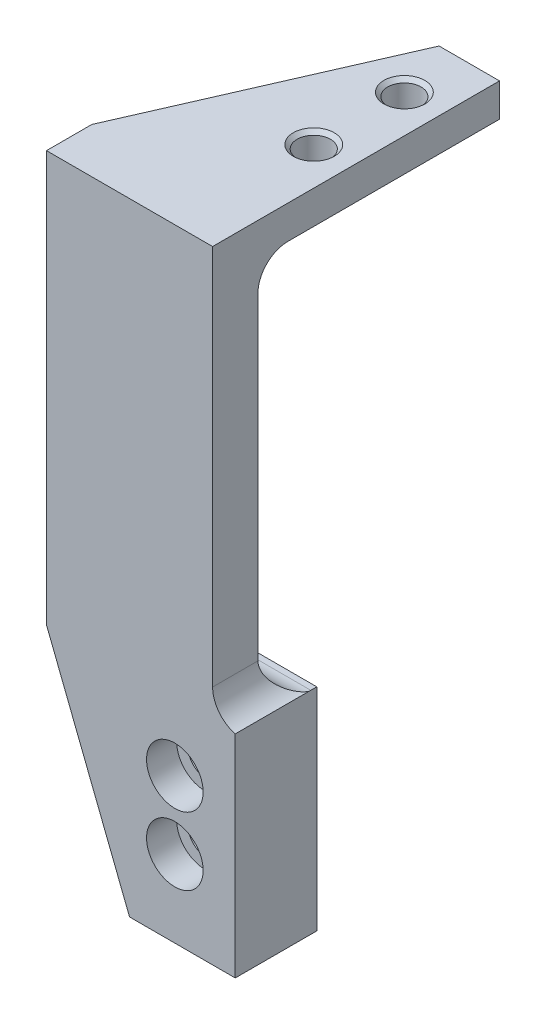
ISO-10303-21;
HEADER;
FILE_DESCRIPTION(('STEP AP214'),'2;1');
FILE_NAME('part.step','',(''),(''),'','','');
FILE_SCHEMA(('AUTOMOTIVE_DESIGN { 1 0 10303 214 1 1 1 1 }'));
ENDSEC;
DATA;
#1=APPLICATION_CONTEXT('core data for automotive mechanical design processes');
#2=APPLICATION_PROTOCOL_DEFINITION('international standard','automotive_design',2000,#1);
#3=PRODUCT_CONTEXT('',#1,'mechanical');
#4=PRODUCT('Part','Part','',(#3));
#5=PRODUCT_RELATED_PRODUCT_CATEGORY('part','',(#4));
#6=PRODUCT_DEFINITION_FORMATION('','',#4);
#7=PRODUCT_DEFINITION_CONTEXT('part definition',#1,'design');
#8=PRODUCT_DEFINITION('design','',#6,#7);
#9=PRODUCT_DEFINITION_SHAPE('','',#8);
#10=(LENGTH_UNIT() NAMED_UNIT(*) SI_UNIT(.MILLI.,.METRE.));
#11=(NAMED_UNIT(*) PLANE_ANGLE_UNIT() SI_UNIT($,.RADIAN.));
#12=(NAMED_UNIT(*) SI_UNIT($,.STERADIAN.) SOLID_ANGLE_UNIT());
#13=UNCERTAINTY_MEASURE_WITH_UNIT(LENGTH_MEASURE(1.E-05),#10,'distance_accuracy_value','');
#14=(GEOMETRIC_REPRESENTATION_CONTEXT(3) GLOBAL_UNCERTAINTY_ASSIGNED_CONTEXT((#13)) GLOBAL_UNIT_ASSIGNED_CONTEXT((#10,
#11,#12)) REPRESENTATION_CONTEXT('',''));
#15=CARTESIAN_POINT('',(0.,0.,0.));
#16=DIRECTION('',(0.,0.,1.));
#17=DIRECTION('',(1.,0.,0.));
#18=AXIS2_PLACEMENT_3D('',#15,#16,#17);
#19=CARTESIAN_POINT('',(-49.6524096385542,36.7948072289157,7.62));
#20=DIRECTION('',(-1.,0.,0.));
#21=DIRECTION('',(0.,-1.,0.));
#22=AXIS2_PLACEMENT_3D('',#19,#20,#21);
#23=PLANE('',#22);
#24=DIRECTION('',(0.,1.,0.));
#25=VECTOR('',#24,1.);
#26=CARTESIAN_POINT('',(-49.6524096385542,36.7948072289157,7.62));
#27=LINE('',#26,#25);
#28=CARTESIAN_POINT('',(-49.6524096385542,-27.3745039214009,7.62));
#29=VERTEX_POINT('',#28);
#30=CARTESIAN_POINT('',(-49.6524096385542,36.7948072289157,7.62));
#31=VERTEX_POINT('',#30);
#32=EDGE_CURVE('E216',#29,#31,#27,.T.);
#33=ORIENTED_EDGE('',*,*,#32,.F.);
#34=DIRECTION('',(0.,0.,1.));
#35=VECTOR('',#34,1.);
#36=CARTESIAN_POINT('',(-49.6524096385542,-27.3745039214009,7.62));
#37=LINE('',#36,#35);
#38=CARTESIAN_POINT('',(-49.6524096385542,-27.3745039214009,-0.0025617962614707));
#39=VERTEX_POINT('',#38);
#40=EDGE_CURVE('E61',#29,#39,#37,.F.);
#41=ORIENTED_EDGE('',*,*,#40,.T.);
#42=CARTESIAN_POINT('',(-49.6524096385542,-27.2131927710843,-5.08));
#43=DIRECTION('',(-1.,0.,0.));
#44=DIRECTION('',(0.,-1.,0.));
#45=AXIS2_PLACEMENT_3D('',#42,#43,#44);
#46=CIRCLE('',#45,5.08);
#47=CARTESIAN_POINT('',(-49.6524096385542,-27.2131927710843,0.));
#48=VERTEX_POINT('',#47);
#49=EDGE_CURVE('E239',#39,#48,#46,.T.);
#50=ORIENTED_EDGE('',*,*,#49,.T.);
#51=DIRECTION('',(0.,1.,0.));
#52=VECTOR('',#51,1.);
#53=CARTESIAN_POINT('',(-49.6524096385542,36.7948072289157,0.));
#54=LINE('',#53,#52);
#55=CARTESIAN_POINT('',(-49.6524096385542,26.1268072289157,0.));
#56=VERTEX_POINT('',#55);
#57=EDGE_CURVE('E217',#48,#56,#54,.T.);
#58=ORIENTED_EDGE('',*,*,#57,.T.);
#59=CARTESIAN_POINT('',(-49.6524096385542,26.1268072289157,-5.08));
#60=DIRECTION('',(-1.,0.,0.));
#61=DIRECTION('',(0.,-1.,0.));
#62=AXIS2_PLACEMENT_3D('',#59,#60,#61);
#63=CIRCLE('',#62,5.08);
#64=CARTESIAN_POINT('',(-49.6524096385542,31.2068072289157,-5.08));
#65=VERTEX_POINT('',#64);
#66=EDGE_CURVE('E228',#56,#65,#63,.T.);
#67=ORIENTED_EDGE('',*,*,#66,.T.);
#68=DIRECTION('',(0.,0.,-1.));
#69=VECTOR('',#68,1.);
#70=CARTESIAN_POINT('',(-49.6524096385542,31.2068072289157,0.));
#71=LINE('',#70,#69);
#72=CARTESIAN_POINT('',(-49.6524096385542,31.2068072289157,-40.64));
#73=VERTEX_POINT('',#72);
#74=EDGE_CURVE('E201',#65,#73,#71,.T.);
#75=ORIENTED_EDGE('',*,*,#74,.T.);
#76=DIRECTION('',(0.,1.,0.));
#77=VECTOR('',#76,1.);
#78=CARTESIAN_POINT('',(-49.6524096385542,31.2068072289157,-40.64));
#79=LINE('',#78,#77);
#80=CARTESIAN_POINT('',(-49.6524096385542,36.7948072289157,-40.64));
#81=VERTEX_POINT('',#80);
#82=EDGE_CURVE('E211',#73,#81,#79,.T.);
#83=ORIENTED_EDGE('',*,*,#82,.T.);
#84=DIRECTION('',(0.,0.,-1.));
#85=VECTOR('',#84,1.);
#86=CARTESIAN_POINT('',(-49.6524096385542,36.7948072289157,7.62));
#87=LINE('',#86,#85);
#88=EDGE_CURVE('E261',#31,#81,#87,.T.);
#89=ORIENTED_EDGE('',*,*,#88,.F.);
#90=EDGE_LOOP('',(#33,#41,#50,#58,#67,#75,#83,#89));
#91=FACE_BOUND('',#90,.T.);
#92=ADVANCED_FACE('F35',(#91),#23,.F.);
#93=CARTESIAN_POINT('',(-77.5924096385542,36.7948072289157,7.62));
#94=DIRECTION('',(1.,0.,0.));
#95=DIRECTION('',(0.,1.,0.));
#96=AXIS2_PLACEMENT_3D('',#93,#94,#95);
#97=PLANE('',#96);
#98=DIRECTION('',(0.,-1.,0.));
#99=VECTOR('',#98,1.);
#100=CARTESIAN_POINT('',(-77.5924096385542,36.7948072289157,0.));
#101=LINE('',#100,#99);
#102=CARTESIAN_POINT('',(-77.5924096385542,36.7948072289157,0.));
#103=VERTEX_POINT('',#102);
#104=CARTESIAN_POINT('',(-77.5924096385542,26.1268072289157,0.));
#105=VERTEX_POINT('',#104);
#106=EDGE_CURVE('E250',#103,#105,#101,.T.);
#107=ORIENTED_EDGE('',*,*,#106,.T.);
#108=CARTESIAN_POINT('',(-77.5924096385542,-27.2131927710843,0.));
#109=VERTEX_POINT('',#108);
#110=EDGE_CURVE('E210',#105,#109,#101,.T.);
#111=ORIENTED_EDGE('',*,*,#110,.T.);
#112=CARTESIAN_POINT('',(-77.5924096385542,-27.2131927710843,-5.08));
#113=DIRECTION('',(1.,0.,0.));
#114=DIRECTION('',(0.,1.,0.));
#115=AXIS2_PLACEMENT_3D('',#112,#113,#114);
#116=CIRCLE('',#115,5.08);
#117=CARTESIAN_POINT('',(-77.5924096385542,-32.2931927710843,-5.08));
#118=VERTEX_POINT('',#117);
#119=EDGE_CURVE('E234',#109,#118,#116,.T.);
#120=ORIENTED_EDGE('',*,*,#119,.T.);
#121=DIRECTION('',(0.,0.,-1.));
#122=VECTOR('',#121,1.);
#123=CARTESIAN_POINT('',(-77.5924096385542,-32.2931927710843,7.62));
#124=LINE('',#123,#122);
#125=CARTESIAN_POINT('',(-77.5924096385542,-32.2931927710843,7.62));
#126=VERTEX_POINT('',#125);
#127=EDGE_CURVE('E259',#126,#118,#124,.T.);
#128=ORIENTED_EDGE('',*,*,#127,.F.);
#129=DIRECTION('',(0.,-1.,0.));
#130=VECTOR('',#129,1.);
#131=CARTESIAN_POINT('',(-77.5924096385542,36.7948072289157,7.62));
#132=LINE('',#131,#130);
#133=CARTESIAN_POINT('',(-77.5924096385542,36.7948072289157,7.62));
#134=VERTEX_POINT('',#133);
#135=EDGE_CURVE('E214',#134,#126,#132,.T.);
#136=ORIENTED_EDGE('',*,*,#135,.F.);
#137=DIRECTION('',(0.,0.,-1.));
#138=VECTOR('',#137,1.);
#139=CARTESIAN_POINT('',(-77.5924096385542,36.7948072289157,7.62));
#140=LINE('',#139,#138);
#141=EDGE_CURVE('E273',#134,#103,#140,.T.);
#142=ORIENTED_EDGE('',*,*,#141,.T.);
#143=EDGE_LOOP('',(#107,#111,#120,#128,#136,#142));
#144=FACE_BOUND('',#143,.T.);
#145=ADVANCED_FACE('F291',(#144),#97,.F.);
#146=CARTESIAN_POINT('',(-77.5924096385542,36.7948072289157,7.62));
#147=DIRECTION('',(0.,-1.,0.));
#148=DIRECTION('',(0.,0.,-1.));
#149=AXIS2_PLACEMENT_3D('',#146,#147,#148);
#150=PLANE('',#149);
#151=CARTESIAN_POINT('',(-56.0024096385542,36.7948072289157,-30.988));
#152=DIRECTION('',(0.,1.,0.));
#153=DIRECTION('',(0.,0.,1.));
#154=AXIS2_PLACEMENT_3D('',#151,#152,#153);
#155=CIRCLE('',#154,3.4417);
#156=CARTESIAN_POINT('',(-56.0024096385542,36.7948072289157,-27.5463));
#157=VERTEX_POINT('',#156);
#158=EDGE_CURVE('E186',#157,#157,#155,.T.);
#159=ORIENTED_EDGE('',*,*,#158,.F.);
#160=EDGE_LOOP('',(#159));
#161=FACE_BOUND('',#160,.T.);
#162=CARTESIAN_POINT('',(-56.0024096385542,36.7948072289157,-15.748));
#163=DIRECTION('',(0.,1.,0.));
#164=DIRECTION('',(0.,0.,1.));
#165=AXIS2_PLACEMENT_3D('',#162,#163,#164);
#166=CIRCLE('',#165,3.4417);
#167=CARTESIAN_POINT('',(-56.0024096385542,36.7948072289157,-12.3063));
#168=VERTEX_POINT('',#167);
#169=EDGE_CURVE('E193',#168,#168,#166,.T.);
#170=ORIENTED_EDGE('',*,*,#169,.F.);
#171=EDGE_LOOP('',(#170));
#172=FACE_BOUND('',#171,.T.);
#173=ORIENTED_EDGE('',*,*,#88,.T.);
#174=DIRECTION('',(-1.,0.,0.));
#175=VECTOR('',#174,1.);
#176=CARTESIAN_POINT('',(-49.6524096385542,36.7948072289157,-40.64));
#177=LINE('',#176,#175);
#178=CARTESIAN_POINT('',(-59.8124096385542,36.7948072289157,-40.64));
#179=VERTEX_POINT('',#178);
#180=EDGE_CURVE('E202',#81,#179,#177,.T.);
#181=ORIENTED_EDGE('',*,*,#180,.T.);
#182=DIRECTION('',(-0.400818834019708,0.,0.916157334902189));
#183=VECTOR('',#182,1.);
#184=CARTESIAN_POINT('',(-59.8124096385542,36.7948072289157,-40.64));
#185=LINE('',#184,#183);
#186=EDGE_CURVE('E205',#179,#103,#185,.T.);
#187=ORIENTED_EDGE('',*,*,#186,.T.);
#188=ORIENTED_EDGE('',*,*,#141,.F.);
#189=DIRECTION('',(-1.,0.,0.));
#190=VECTOR('',#189,1.);
#191=CARTESIAN_POINT('',(-77.5924096385542,36.7948072289157,7.62));
#192=LINE('',#191,#190);
#193=EDGE_CURVE('E220',#31,#134,#192,.T.);
#194=ORIENTED_EDGE('',*,*,#193,.F.);
#195=EDGE_LOOP('',(#173,#181,#187,#188,#194));
#196=FACE_BOUND('',#195,.T.);
#197=ADVANCED_FACE('F278',(#161,#172,#196),#150,.F.);
#198=CARTESIAN_POINT('',(-77.5924096385542,36.7948072289157,7.62));
#199=DIRECTION('',(0.,0.,1.));
#200=DIRECTION('',(1.,0.,0.));
#201=AXIS2_PLACEMENT_3D('',#198,#199,#200);
#202=PLANE('',#201);
#203=CARTESIAN_POINT('',(-56.0024096385542,-43.4691927710843,7.62));
#204=DIRECTION('',(0.,0.,1.));
#205=DIRECTION('',(1.,0.,0.));
#206=AXIS2_PLACEMENT_3D('',#203,#204,#205);
#207=CIRCLE('',#206,4.76249999999999);
#208=CARTESIAN_POINT('',(-51.2399096385542,-43.4691927710843,7.62));
#209=VERTEX_POINT('',#208);
#210=EDGE_CURVE('E591',#209,#209,#207,.T.);
#211=ORIENTED_EDGE('',*,*,#210,.F.);
#212=EDGE_LOOP('',(#211));
#213=FACE_BOUND('',#212,.T.);
#214=CARTESIAN_POINT('',(-56.0024096385542,-54.8991927710843,7.62));
#215=DIRECTION('',(0.,0.,1.));
#216=DIRECTION('',(1.,0.,0.));
#217=AXIS2_PLACEMENT_3D('',#214,#215,#216);
#218=CIRCLE('',#217,4.76249999999999);
#219=CARTESIAN_POINT('',(-51.2399096385542,-54.8991927710843,7.62));
#220=VERTEX_POINT('',#219);
#221=EDGE_CURVE('E581',#220,#220,#218,.T.);
#222=ORIENTED_EDGE('',*,*,#221,.F.);
#223=EDGE_LOOP('',(#222));
#224=FACE_BOUND('',#223,.T.);
#225=ORIENTED_EDGE('',*,*,#135,.T.);
#226=DIRECTION('',(0.365652372422994,-0.930751493440347,0.));
#227=VECTOR('',#226,1.);
#228=CARTESIAN_POINT('',(-77.5924096385542,-32.2931927710843,7.62));
#229=LINE('',#228,#227);
#230=CARTESIAN_POINT('',(-63.6224096385542,-67.8531927710843,7.62));
#231=VERTEX_POINT('',#230);
#232=EDGE_CURVE('E169',#126,#231,#229,.T.);
#233=ORIENTED_EDGE('',*,*,#232,.T.);
#234=DIRECTION('',(1.,0.,0.));
#235=VECTOR('',#234,1.);
#236=CARTESIAN_POINT('',(-63.6224096385542,-67.8531927710843,7.62));
#237=LINE('',#236,#235);
#238=CARTESIAN_POINT('',(-45.8424096385542,-67.8531927710843,7.62));
#239=VERTEX_POINT('',#238);
#240=EDGE_CURVE('E142',#231,#239,#237,.T.);
#241=ORIENTED_EDGE('',*,*,#240,.T.);
#242=DIRECTION('',(0.,-1.,0.));
#243=VECTOR('',#242,1.);
#244=CARTESIAN_POINT('',(-45.8424096385542,-32.2931927710843,7.62));
#245=LINE('',#244,#243);
#246=CARTESIAN_POINT('',(-45.8424096385542,-32.2931927710843,7.62));
#247=VERTEX_POINT('',#246);
#248=EDGE_CURVE('E152',#247,#239,#245,.T.);
#249=ORIENTED_EDGE('',*,*,#248,.F.);
#250=CARTESIAN_POINT('',(-44.5724096385542,-27.3745039214009,7.62));
#251=DIRECTION('',(0.,0.,1.));
#252=DIRECTION('',(1.,0.,0.));
#253=AXIS2_PLACEMENT_3D('',#250,#251,#252);
#254=CIRCLE('',#253,5.08);
#255=EDGE_CURVE('E48',#247,#29,#254,.F.);
#256=ORIENTED_EDGE('',*,*,#255,.T.);
#257=ORIENTED_EDGE('',*,*,#32,.T.);
#258=ORIENTED_EDGE('',*,*,#193,.T.);
#259=EDGE_LOOP('',(#225,#233,#241,#249,#256,#257,#258));
#260=FACE_BOUND('',#259,.T.);
#261=ADVANCED_FACE('F295',(#213,#224,#260),#202,.T.);
#262=CARTESIAN_POINT('',(-77.5924096385542,36.7948072289157,0.));
#263=DIRECTION('',(0.,0.,1.));
#264=DIRECTION('',(1.,0.,0.));
#265=AXIS2_PLACEMENT_3D('',#262,#263,#264);
#266=PLANE('',#265);
#267=ORIENTED_EDGE('',*,*,#57,.F.);
#268=DIRECTION('',(1.,0.,0.));
#269=VECTOR('',#268,1.);
#270=CARTESIAN_POINT('',(-77.5924096385542,-27.2131927710843,0.));
#271=LINE('',#270,#269);
#272=EDGE_CURVE('E243',#48,#109,#271,.F.);
#273=ORIENTED_EDGE('',*,*,#272,.T.);
#274=ORIENTED_EDGE('',*,*,#110,.F.);
#275=DIRECTION('',(1.,0.,0.));
#276=VECTOR('',#275,1.);
#277=CARTESIAN_POINT('',(-49.6524096385542,26.1268072289157,0.));
#278=LINE('',#277,#276);
#279=EDGE_CURVE('E265',#105,#56,#278,.T.);
#280=ORIENTED_EDGE('',*,*,#279,.T.);
#281=EDGE_LOOP('',(#267,#273,#274,#280));
#282=FACE_BOUND('',#281,.T.);
#283=ADVANCED_FACE('F306',(#282),#266,.F.);
#284=CARTESIAN_POINT('',(-59.8124096385542,31.2068072289157,-40.64));
#285=DIRECTION('',(-0.916157334902189,0.,-0.400818834019708));
#286=DIRECTION('',(-0.400818834019708,0.,0.916157334902189));
#287=AXIS2_PLACEMENT_3D('',#284,#285,#286);
#288=PLANE('',#287);
#289=ORIENTED_EDGE('',*,*,#186,.F.);
#290=DIRECTION('',(0.,1.,0.));
#291=VECTOR('',#290,1.);
#292=CARTESIAN_POINT('',(-59.8124096385542,31.2068072289157,-40.64));
#293=LINE('',#292,#291);
#294=CARTESIAN_POINT('',(-59.8124096385542,31.2068072289157,-40.64));
#295=VERTEX_POINT('',#294);
#296=EDGE_CURVE('E208',#295,#179,#293,.T.);
#297=ORIENTED_EDGE('',*,*,#296,.F.);
#298=DIRECTION('',(-0.400818834019708,0.,0.916157334902189));
#299=VECTOR('',#298,1.);
#300=CARTESIAN_POINT('',(-59.8124096385542,31.2068072289157,-40.64));
#301=LINE('',#300,#299);
#302=CARTESIAN_POINT('',(-75.3699096385542,31.2068072289157,-5.08));
#303=VERTEX_POINT('',#302);
#304=EDGE_CURVE('E200',#295,#303,#301,.T.);
#305=ORIENTED_EDGE('',*,*,#304,.T.);
#306=CARTESIAN_POINT('',(-75.3699096385542,26.1268072289157,-5.08));
#307=DIRECTION('',(-0.916157334902189,0.,-0.400818834019708));
#308=DIRECTION('',(-0.400818834019708,0.,0.916157334902189));
#309=AXIS2_PLACEMENT_3D('',#306,#307,#308);
#310=ELLIPSE('',#309,5.54489911991192,5.08);
#311=EDGE_CURVE('E226',#303,#105,#310,.F.);
#312=ORIENTED_EDGE('',*,*,#311,.T.);
#313=ORIENTED_EDGE('',*,*,#106,.F.);
#314=EDGE_LOOP('',(#289,#297,#305,#312,#313));
#315=FACE_BOUND('',#314,.T.);
#316=ADVANCED_FACE('F288',(#315),#288,.T.);
#317=CARTESIAN_POINT('',(-49.6524096385542,31.2068072289157,-40.64));
#318=DIRECTION('',(0.,0.,-1.));
#319=DIRECTION('',(-1.,0.,0.));
#320=AXIS2_PLACEMENT_3D('',#317,#318,#319);
#321=PLANE('',#320);
#322=ORIENTED_EDGE('',*,*,#180,.F.);
#323=ORIENTED_EDGE('',*,*,#82,.F.);
#324=DIRECTION('',(-1.,0.,0.));
#325=VECTOR('',#324,1.);
#326=CARTESIAN_POINT('',(-49.6524096385542,31.2068072289157,-40.64));
#327=LINE('',#326,#325);
#328=EDGE_CURVE('E197',#73,#295,#327,.T.);
#329=ORIENTED_EDGE('',*,*,#328,.T.);
#330=ORIENTED_EDGE('',*,*,#296,.T.);
#331=EDGE_LOOP('',(#322,#323,#329,#330));
#332=FACE_BOUND('',#331,.T.);
#333=ADVANCED_FACE('F286',(#332),#321,.T.);
#334=CARTESIAN_POINT('',(-49.6524096385542,31.2068072289157,0.));
#335=DIRECTION('',(0.,1.,0.));
#336=DIRECTION('',(0.,0.,1.));
#337=AXIS2_PLACEMENT_3D('',#334,#335,#336);
#338=PLANE('',#337);
#339=CARTESIAN_POINT('',(-56.0024096385542,31.2068072289157,-30.988));
#340=DIRECTION('',(0.,1.,0.));
#341=DIRECTION('',(0.,0.,1.));
#342=AXIS2_PLACEMENT_3D('',#339,#340,#341);
#343=CIRCLE('',#342,2.80669999999999);
#344=CARTESIAN_POINT('',(-56.0024096385542,31.2068072289157,-28.1813));
#345=VERTEX_POINT('',#344);
#346=EDGE_CURVE('E189',#345,#345,#343,.T.);
#347=ORIENTED_EDGE('',*,*,#346,.T.);
#348=EDGE_LOOP('',(#347));
#349=FACE_BOUND('',#348,.T.);
#350=CARTESIAN_POINT('',(-56.0024096385542,31.2068072289157,-15.748));
#351=DIRECTION('',(0.,1.,0.));
#352=DIRECTION('',(0.,0.,1.));
#353=AXIS2_PLACEMENT_3D('',#350,#351,#352);
#354=CIRCLE('',#353,2.80669999999999);
#355=CARTESIAN_POINT('',(-56.0024096385542,31.2068072289157,-12.9413));
#356=VERTEX_POINT('',#355);
#357=EDGE_CURVE('E196',#356,#356,#354,.T.);
#358=ORIENTED_EDGE('',*,*,#357,.T.);
#359=EDGE_LOOP('',(#358));
#360=FACE_BOUND('',#359,.T.);
#361=ORIENTED_EDGE('',*,*,#74,.F.);
#362=DIRECTION('',(1.,0.,0.));
#363=VECTOR('',#362,1.);
#364=CARTESIAN_POINT('',(-77.5924096385542,31.2068072289157,-5.08));
#365=LINE('',#364,#363);
#366=EDGE_CURVE('E241',#65,#303,#365,.F.);
#367=ORIENTED_EDGE('',*,*,#366,.T.);
#368=ORIENTED_EDGE('',*,*,#304,.F.);
#369=ORIENTED_EDGE('',*,*,#328,.F.);
#370=EDGE_LOOP('',(#361,#367,#368,#369));
#371=FACE_BOUND('',#370,.T.);
#372=ADVANCED_FACE('F311',(#349,#360,#371),#338,.F.);
#373=CARTESIAN_POINT('',(-56.0024096385542,36.7948072289157,-15.748));
#374=DIRECTION('',(0.,1.,0.));
#375=DIRECTION('',(0.,0.,1.));
#376=AXIS2_PLACEMENT_3D('',#373,#374,#375);
#377=CYLINDRICAL_SURFACE('',#376,2.80669999999999);
#378=CARTESIAN_POINT('',(-56.0024096385542,36.1598072289157,-15.748));
#379=DIRECTION('',(0.,1.,0.));
#380=DIRECTION('',(0.,0.,1.));
#381=AXIS2_PLACEMENT_3D('',#378,#379,#380);
#382=CIRCLE('',#381,2.80669999999999);
#383=CARTESIAN_POINT('',(-56.0024096385542,36.1598072289157,-12.9413));
#384=VERTEX_POINT('',#383);
#385=EDGE_CURVE('E190',#384,#384,#382,.T.);
#386=ORIENTED_EDGE('',*,*,#385,.T.);
#387=EDGE_LOOP('',(#386));
#388=FACE_BOUND('',#387,.T.);
#389=ORIENTED_EDGE('',*,*,#357,.F.);
#390=EDGE_LOOP('',(#389));
#391=FACE_BOUND('',#390,.T.);
#392=ADVANCED_FACE('F313',(#388,#391),#377,.F.);
#393=CARTESIAN_POINT('',(-56.0024096385542,36.7948072289157,-15.748));
#394=DIRECTION('',(0.,1.,0.));
#395=DIRECTION('',(0.,0.,1.));
#396=AXIS2_PLACEMENT_3D('',#393,#394,#395);
#397=CONICAL_SURFACE('',#396,3.4417,0.785398163397448);
#398=ORIENTED_EDGE('',*,*,#385,.F.);
#399=EDGE_LOOP('',(#398));
#400=FACE_BOUND('',#399,.T.);
#401=ORIENTED_EDGE('',*,*,#169,.T.);
#402=EDGE_LOOP('',(#401));
#403=FACE_BOUND('',#402,.T.);
#404=ADVANCED_FACE('F320',(#400,#403),#397,.F.);
#405=CARTESIAN_POINT('',(-56.0024096385542,36.7948072289157,-30.988));
#406=DIRECTION('',(0.,1.,0.));
#407=DIRECTION('',(0.,0.,1.));
#408=AXIS2_PLACEMENT_3D('',#405,#406,#407);
#409=CYLINDRICAL_SURFACE('',#408,2.80669999999999);
#410=CARTESIAN_POINT('',(-56.0024096385542,36.1598072289157,-30.988));
#411=DIRECTION('',(0.,1.,0.));
#412=DIRECTION('',(0.,0.,1.));
#413=AXIS2_PLACEMENT_3D('',#410,#411,#412);
#414=CIRCLE('',#413,2.80669999999999);
#415=CARTESIAN_POINT('',(-56.0024096385542,36.1598072289157,-28.1813));
#416=VERTEX_POINT('',#415);
#417=EDGE_CURVE('E180',#416,#416,#414,.T.);
#418=ORIENTED_EDGE('',*,*,#417,.T.);
#419=EDGE_LOOP('',(#418));
#420=FACE_BOUND('',#419,.T.);
#421=ORIENTED_EDGE('',*,*,#346,.F.);
#422=EDGE_LOOP('',(#421));
#423=FACE_BOUND('',#422,.T.);
#424=ADVANCED_FACE('F370',(#420,#423),#409,.F.);
#425=CARTESIAN_POINT('',(-56.0024096385542,36.7948072289157,-30.988));
#426=DIRECTION('',(0.,1.,0.));
#427=DIRECTION('',(0.,0.,1.));
#428=AXIS2_PLACEMENT_3D('',#425,#426,#427);
#429=CONICAL_SURFACE('',#428,3.4417,0.785398163397448);
#430=ORIENTED_EDGE('',*,*,#417,.F.);
#431=EDGE_LOOP('',(#430));
#432=FACE_BOUND('',#431,.T.);
#433=ORIENTED_EDGE('',*,*,#158,.T.);
#434=EDGE_LOOP('',(#433));
#435=FACE_BOUND('',#434,.T.);
#436=ADVANCED_FACE('F369',(#432,#435),#429,.F.);
#437=CARTESIAN_POINT('',(-77.5924096385542,-32.2931927710843,-6.096));
#438=DIRECTION('',(0.,1.,0.));
#439=DIRECTION('',(0.,0.,1.));
#440=AXIS2_PLACEMENT_3D('',#437,#438,#439);
#441=PLANE('',#440);
#442=DIRECTION('',(1.,0.,0.));
#443=VECTOR('',#442,1.);
#444=CARTESIAN_POINT('',(-77.5924096385542,-32.2931927710843,-5.08));
#445=LINE('',#444,#443);
#446=CARTESIAN_POINT('',(-45.8424096385542,-32.2931927710843,-5.08));
#447=VERTEX_POINT('',#446);
#448=EDGE_CURVE('E148',#118,#447,#445,.T.);
#449=ORIENTED_EDGE('',*,*,#448,.T.);
#450=DIRECTION('',(0.,0.,1.));
#451=VECTOR('',#450,1.);
#452=CARTESIAN_POINT('',(-45.8424096385542,-32.2931927710843,-6.096));
#453=LINE('',#452,#451);
#454=CARTESIAN_POINT('',(-45.8424096385542,-32.2931927710843,-6.096));
#455=VERTEX_POINT('',#454);
#456=EDGE_CURVE('E145',#455,#447,#453,.T.);
#457=ORIENTED_EDGE('',*,*,#456,.F.);
#458=DIRECTION('',(-1.,0.,0.));
#459=VECTOR('',#458,1.);
#460=CARTESIAN_POINT('',(-77.5924096385542,-32.2931927710843,-6.096));
#461=LINE('',#460,#459);
#462=CARTESIAN_POINT('',(-77.5924096385542,-32.2931927710843,-6.096));
#463=VERTEX_POINT('',#462);
#464=EDGE_CURVE('E132',#455,#463,#461,.T.);
#465=ORIENTED_EDGE('',*,*,#464,.T.);
#466=DIRECTION('',(0.,0.,1.));
#467=VECTOR('',#466,1.);
#468=CARTESIAN_POINT('',(-77.5924096385542,-32.2931927710843,-6.096));
#469=LINE('',#468,#467);
#470=EDGE_CURVE('E174',#463,#118,#469,.T.);
#471=ORIENTED_EDGE('',*,*,#470,.T.);
#472=EDGE_LOOP('',(#449,#457,#465,#471));
#473=FACE_BOUND('',#472,.T.);
#474=ADVANCED_FACE('F146',(#473),#441,.T.);
#475=CARTESIAN_POINT('',(-63.6224096385542,-67.8531927710843,-6.096));
#476=DIRECTION('',(0.,-1.,0.));
#477=DIRECTION('',(0.,0.,-1.));
#478=AXIS2_PLACEMENT_3D('',#475,#476,#477);
#479=PLANE('',#478);
#480=ORIENTED_EDGE('',*,*,#240,.F.);
#481=DIRECTION('',(0.,0.,1.));
#482=VECTOR('',#481,1.);
#483=CARTESIAN_POINT('',(-63.6224096385542,-67.8531927710843,-6.096));
#484=LINE('',#483,#482);
#485=CARTESIAN_POINT('',(-63.6224096385542,-67.8531927710843,-6.096));
#486=VERTEX_POINT('',#485);
#487=EDGE_CURVE('E178',#486,#231,#484,.T.);
#488=ORIENTED_EDGE('',*,*,#487,.F.);
#489=DIRECTION('',(1.,0.,0.));
#490=VECTOR('',#489,1.);
#491=CARTESIAN_POINT('',(-63.6224096385542,-67.8531927710843,-6.096));
#492=LINE('',#491,#490);
#493=CARTESIAN_POINT('',(-45.8424096385542,-67.8531927710843,-6.096));
#494=VERTEX_POINT('',#493);
#495=EDGE_CURVE('E172',#486,#494,#492,.T.);
#496=ORIENTED_EDGE('',*,*,#495,.T.);
#497=DIRECTION('',(0.,0.,-1.));
#498=VECTOR('',#497,1.);
#499=CARTESIAN_POINT('',(-45.8424096385542,-67.8531927710843,-6.096));
#500=LINE('',#499,#498);
#501=EDGE_CURVE('E159',#239,#494,#500,.T.);
#502=ORIENTED_EDGE('',*,*,#501,.F.);
#503=EDGE_LOOP('',(#480,#488,#496,#502));
#504=FACE_BOUND('',#503,.T.);
#505=ADVANCED_FACE('F360',(#504),#479,.T.);
#506=CARTESIAN_POINT('',(-77.5924096385542,-32.2931927710843,-6.096));
#507=DIRECTION('',(-0.930751493440347,-0.365652372422994,0.));
#508=DIRECTION('',(0.365652372422994,-0.930751493440347,0.));
#509=AXIS2_PLACEMENT_3D('',#506,#507,#508);
#510=PLANE('',#509);
#511=ORIENTED_EDGE('',*,*,#232,.F.);
#512=ORIENTED_EDGE('',*,*,#127,.T.);
#513=ORIENTED_EDGE('',*,*,#470,.F.);
#514=DIRECTION('',(0.365652372422994,-0.930751493440347,0.));
#515=VECTOR('',#514,1.);
#516=CARTESIAN_POINT('',(-77.5924096385542,-32.2931927710843,-6.096));
#517=LINE('',#516,#515);
#518=EDGE_CURVE('E139',#463,#486,#517,.T.);
#519=ORIENTED_EDGE('',*,*,#518,.T.);
#520=ORIENTED_EDGE('',*,*,#487,.T.);
#521=EDGE_LOOP('',(#511,#512,#513,#519,#520));
#522=FACE_BOUND('',#521,.T.);
#523=ADVANCED_FACE('F358',(#522),#510,.T.);
#524=CARTESIAN_POINT('',(-49.6524096385542,-32.2931927710843,-6.096));
#525=DIRECTION('',(0.,0.,-1.));
#526=DIRECTION('',(-1.,0.,0.));
#527=AXIS2_PLACEMENT_3D('',#524,#525,#526);
#528=PLANE('',#527);
#529=CARTESIAN_POINT('',(-56.0024096385542,-43.4691927710843,-6.096));
#530=DIRECTION('',(0.,0.,-1.));
#531=DIRECTION('',(-1.,0.,0.));
#532=AXIS2_PLACEMENT_3D('',#529,#530,#531);
#533=CIRCLE('',#532,2.8067);
#534=CARTESIAN_POINT('',(-58.8091096385542,-43.4691927710843,-6.096));
#535=VERTEX_POINT('',#534);
#536=EDGE_CURVE('E225',#535,#535,#533,.T.);
#537=ORIENTED_EDGE('',*,*,#536,.F.);
#538=EDGE_LOOP('',(#537));
#539=FACE_BOUND('',#538,.T.);
#540=CARTESIAN_POINT('',(-56.0024096385542,-54.8991927710843,-6.096));
#541=DIRECTION('',(0.,0.,-1.));
#542=DIRECTION('',(-1.,0.,0.));
#543=AXIS2_PLACEMENT_3D('',#540,#541,#542);
#544=CIRCLE('',#543,2.8067);
#545=CARTESIAN_POINT('',(-58.8091096385542,-54.8991927710843,-6.096));
#546=VERTEX_POINT('',#545);
#547=EDGE_CURVE('E160',#546,#546,#544,.T.);
#548=ORIENTED_EDGE('',*,*,#547,.F.);
#549=EDGE_LOOP('',(#548));
#550=FACE_BOUND('',#549,.T.);
#551=ORIENTED_EDGE('',*,*,#464,.F.);
#552=DIRECTION('',(0.,1.,0.));
#553=VECTOR('',#552,1.);
#554=CARTESIAN_POINT('',(-45.8424096385542,-32.2931927710843,-6.096));
#555=LINE('',#554,#553);
#556=EDGE_CURVE('E137',#494,#455,#555,.T.);
#557=ORIENTED_EDGE('',*,*,#556,.F.);
#558=ORIENTED_EDGE('',*,*,#495,.F.);
#559=ORIENTED_EDGE('',*,*,#518,.F.);
#560=EDGE_LOOP('',(#551,#557,#558,#559));
#561=FACE_BOUND('',#560,.T.);
#562=ADVANCED_FACE('F134',(#539,#550,#561),#528,.T.);
#563=CARTESIAN_POINT('',(-45.8424096385542,-67.8531927710843,-6.096));
#564=DIRECTION('',(-1.,0.,0.));
#565=DIRECTION('',(0.,-1.,0.));
#566=AXIS2_PLACEMENT_3D('',#563,#564,#565);
#567=PLANE('',#566);
#568=ORIENTED_EDGE('',*,*,#556,.T.);
#569=ORIENTED_EDGE('',*,*,#456,.T.);
#570=EDGE_CURVE('E153',#447,#247,#453,.T.);
#571=ORIENTED_EDGE('',*,*,#570,.T.);
#572=ORIENTED_EDGE('',*,*,#248,.T.);
#573=ORIENTED_EDGE('',*,*,#501,.T.);
#574=EDGE_LOOP('',(#568,#569,#571,#572,#573));
#575=FACE_BOUND('',#574,.T.);
#576=ADVANCED_FACE('F156',(#575),#567,.F.);
#577=CARTESIAN_POINT('',(-77.5924096385542,-27.2131927710843,-5.08));
#578=DIRECTION('',(1.,0.,0.));
#579=DIRECTION('',(0.,0.,-1.));
#580=AXIS2_PLACEMENT_3D('',#577,#578,#579);
#581=CYLINDRICAL_SURFACE('',#580,5.08);
#582=ORIENTED_EDGE('',*,*,#119,.F.);
#583=ORIENTED_EDGE('',*,*,#272,.F.);
#584=ORIENTED_EDGE('',*,*,#49,.F.);
#585=CARTESIAN_POINT('',(-49.6524096385542,-27.3745039214009,-0.0025617962614707));
#586=CARTESIAN_POINT('',(-49.6524392747753,-27.4894610944907,-0.00618413864768682));
#587=CARTESIAN_POINT('',(-49.6485089269081,-27.6042687724838,-0.0137680487816476));
#588=CARTESIAN_POINT('',(-49.6330051099386,-27.8325032006635,-0.0365969720768573));
#589=CARTESIAN_POINT('',(-49.6214382002378,-27.9459310509691,-0.0518354077227177));
#590=CARTESIAN_POINT('',(-49.5910686575606,-28.1695566873833,-0.0895551924148409));
#591=CARTESIAN_POINT('',(-49.5723292428898,-28.2797738862105,-0.111972988490249));
#592=CARTESIAN_POINT('',(-49.5280400894045,-28.4971942862838,-0.163677700711288));
#593=CARTESIAN_POINT('',(-49.5024892283345,-28.60439698764,-0.192965748705777));
#594=CARTESIAN_POINT('',(-49.4451868518087,-28.8147416816784,-0.257810345387865));
#595=CARTESIAN_POINT('',(-49.4134571708024,-28.917896479675,-0.293344779045375));
#596=CARTESIAN_POINT('',(-49.3442910777298,-29.1200620465364,-0.37022744052807));
#597=CARTESIAN_POINT('',(-49.3068525163816,-29.2190712366922,-0.411577857500304));
#598=CARTESIAN_POINT('',(-49.1867112169713,-29.5095803510395,-0.543671872775685));
#599=CARTESIAN_POINT('',(-49.0962531909496,-29.6943113957487,-0.642379137776442));
#600=CARTESIAN_POINT('',(-48.8573997143894,-30.1180240134706,-0.90224395787759));
#601=CARTESIAN_POINT('',(-48.7006775754094,-30.3469257558585,-1.07216174210146));
#602=CARTESIAN_POINT('',(-48.4491214132637,-30.6601639451892,-1.34581558773547));
#603=CARTESIAN_POINT('',(-48.3623602041011,-30.7597028823914,-1.44034209484784));
#604=CARTESIAN_POINT('',(-48.1843872622555,-30.9489787377067,-1.63490216923308));
#605=CARTESIAN_POINT('',(-48.0931758733399,-31.0387164112183,-1.73493531120605));
#606=CARTESIAN_POINT('',(-47.8755825381148,-31.2376620466257,-1.97484787912718));
#607=CARTESIAN_POINT('',(-47.7478342867752,-31.3430426633107,-2.11666120139665));
#608=CARTESIAN_POINT('',(-47.488544319049,-31.5372937892326,-2.40806471247877));
#609=CARTESIAN_POINT('',(-47.3569998960435,-31.6261521646769,-2.55766051430443));
#610=CARTESIAN_POINT('',(-47.0930588372643,-31.7877292850604,-2.86414180957364));
#611=CARTESIAN_POINT('',(-46.9606640119033,-31.8604749846047,-3.02101458943493));
#612=CARTESIAN_POINT('',(-46.7644173950915,-31.957827064521,-3.26276073643632));
#613=CARTESIAN_POINT('',(-46.6994185296436,-31.9883067580234,-3.34438140832767));
#614=CARTESIAN_POINT('',(-46.5710228121002,-32.0453573844208,-3.51019911642613));
#615=CARTESIAN_POINT('',(-46.5076256348393,-32.0719291160555,-3.59439562190266));
#616=CARTESIAN_POINT('',(-46.3688190492703,-32.1269897378629,-3.7864572319581));
#617=CARTESIAN_POINT('',(-46.2941571357461,-32.1544207304338,-3.89517236356911));
#618=CARTESIAN_POINT('',(-46.153154470476,-32.2028723120812,-4.11944277477539));
#619=CARTESIAN_POINT('',(-46.0868094053145,-32.2238962322597,-4.2349944625301));
#620=CARTESIAN_POINT('',(-45.9895014542776,-32.2530252564485,-4.43710558464083));
#621=CARTESIAN_POINT('',(-45.9540060465468,-32.2631118272143,-4.521135290926));
#622=CARTESIAN_POINT('',(-45.8957194020732,-32.279214267017,-4.69369400602233));
#623=CARTESIAN_POINT('',(-45.8728591278273,-32.2852522964254,-4.78219562177395));
#624=CARTESIAN_POINT('',(-45.8534074981834,-32.2903428912101,-4.9064091148274));
#625=CARTESIAN_POINT('',(-45.8493140951108,-32.2914061026584,-4.94090857150198));
#626=CARTESIAN_POINT('',(-45.8438033562591,-32.2928331245613,-5.01026484630382));
#627=CARTESIAN_POINT('',(-45.8423962076878,-32.2931942726427,-5.04512252278477));
#628=CARTESIAN_POINT('',(-45.8424096385542,-32.2931927710843,-5.08));
#629=B_SPLINE_CURVE_WITH_KNOTS('',3,(#585,#586,#587,#588,#589,#590,#591,#592,#593,#594,#595,
#596,#597,#598,#599,#600,#601,#602,#603,#604,#605,#606,#607,#608,#609,#610,#611,#612,#613,#614,
#615,#616,#617,#618,#619,#620,#621,#622,#623,#624,#625,#626,#627,#628),.UNSPECIFIED.,.F.,.F.,(4,
2,2,2,2,2,2,2,2,2,2,2,2,2,2,2,2,2,2,2,2,4),(0.,0.344871475714485,0.689447109855085,
1.03105310919974,1.37271542645674,1.71319161174348,2.05379629758614,2.73581215275238,
3.7061472631245,4.19299420840902,4.6798036051274,5.33298684038873,5.9866478893978,
6.63920704017151,6.96522380926425,7.29117385162838,7.6949743886343,8.09856462606442,
8.37323291487468,8.64638521233725,8.75055780560274,8.85512467867612),.UNSPECIFIED.);
#630=EDGE_CURVE('E11',#39,#447,#629,.T.);
#631=ORIENTED_EDGE('',*,*,#630,.T.);
#632=ORIENTED_EDGE('',*,*,#448,.F.);
#633=EDGE_LOOP('',(#582,#583,#584,#631,#632));
#634=FACE_BOUND('',#633,.T.);
#635=ADVANCED_FACE('F300',(#634),#581,.F.);
#636=CARTESIAN_POINT('',(-77.5924096385542,26.1268072289157,-5.08));
#637=DIRECTION('',(-1.,0.,0.));
#638=DIRECTION('',(0.,0.,1.));
#639=AXIS2_PLACEMENT_3D('',#636,#637,#638);
#640=CYLINDRICAL_SURFACE('',#639,5.08);
#641=ORIENTED_EDGE('',*,*,#311,.F.);
#642=ORIENTED_EDGE('',*,*,#366,.F.);
#643=ORIENTED_EDGE('',*,*,#66,.F.);
#644=ORIENTED_EDGE('',*,*,#279,.F.);
#645=EDGE_LOOP('',(#641,#642,#643,#644));
#646=FACE_BOUND('',#645,.T.);
#647=ADVANCED_FACE('F308',(#646),#640,.F.);
#648=CARTESIAN_POINT('',(-56.0024096385542,-54.8991927710843,7.62));
#649=DIRECTION('',(0.,0.,1.));
#650=DIRECTION('',(1.,0.,0.));
#651=AXIS2_PLACEMENT_3D('',#648,#649,#650);
#652=CYLINDRICAL_SURFACE('',#651,2.8067);
#653=ORIENTED_EDGE('',*,*,#547,.T.);
#654=EDGE_LOOP('',(#653));
#655=FACE_BOUND('',#654,.T.);
#656=CARTESIAN_POINT('',(-56.0024096385542,-54.8991927710843,2.54));
#657=DIRECTION('',(0.,0.,1.));
#658=DIRECTION('',(1.,0.,0.));
#659=AXIS2_PLACEMENT_3D('',#656,#657,#658);
#660=CIRCLE('',#659,2.8067);
#661=CARTESIAN_POINT('',(-53.1957096385542,-54.8991927710843,2.54));
#662=VERTEX_POINT('',#661);
#663=EDGE_CURVE('E163',#662,#662,#660,.T.);
#664=ORIENTED_EDGE('',*,*,#663,.T.);
#665=EDGE_LOOP('',(#664));
#666=FACE_BOUND('',#665,.T.);
#667=ADVANCED_FACE('F338',(#655,#666),#652,.F.);
#668=CARTESIAN_POINT('',(-53.1957096385542,-54.8991927710843,2.54));
#669=DIRECTION('',(0.,0.,-1.));
#670=DIRECTION('',(-1.,0.,0.));
#671=AXIS2_PLACEMENT_3D('',#668,#669,#670);
#672=PLANE('',#671);
#673=ORIENTED_EDGE('',*,*,#663,.F.);
#674=EDGE_LOOP('',(#673));
#675=FACE_BOUND('',#674,.T.);
#676=CARTESIAN_POINT('',(-56.0024096385542,-54.8991927710843,2.54));
#677=DIRECTION('',(0.,0.,1.));
#678=DIRECTION('',(1.,0.,0.));
#679=AXIS2_PLACEMENT_3D('',#676,#677,#678);
#680=CIRCLE('',#679,4.7625);
#681=CARTESIAN_POINT('',(-51.2399096385542,-54.8991927710843,2.54));
#682=VERTEX_POINT('',#681);
#683=EDGE_CURVE('E578',#682,#682,#680,.T.);
#684=ORIENTED_EDGE('',*,*,#683,.T.);
#685=EDGE_LOOP('',(#684));
#686=FACE_BOUND('',#685,.T.);
#687=ADVANCED_FACE('F342',(#675,#686),#672,.F.);
#688=CARTESIAN_POINT('',(-56.0024096385542,-54.8991927710843,7.62));
#689=DIRECTION('',(0.,0.,1.));
#690=DIRECTION('',(1.,0.,0.));
#691=AXIS2_PLACEMENT_3D('',#688,#689,#690);
#692=CYLINDRICAL_SURFACE('',#691,4.76249999999999);
#693=ORIENTED_EDGE('',*,*,#683,.F.);
#694=EDGE_LOOP('',(#693));
#695=FACE_BOUND('',#694,.T.);
#696=ORIENTED_EDGE('',*,*,#221,.T.);
#697=EDGE_LOOP('',(#696));
#698=FACE_BOUND('',#697,.T.);
#699=ADVANCED_FACE('F348',(#695,#698),#692,.F.);
#700=CARTESIAN_POINT('',(-56.0024096385542,-43.4691927710843,7.62));
#701=DIRECTION('',(0.,0.,1.));
#702=DIRECTION('',(1.,0.,0.));
#703=AXIS2_PLACEMENT_3D('',#700,#701,#702);
#704=CYLINDRICAL_SURFACE('',#703,2.8067);
#705=ORIENTED_EDGE('',*,*,#536,.T.);
#706=EDGE_LOOP('',(#705));
#707=FACE_BOUND('',#706,.T.);
#708=CARTESIAN_POINT('',(-56.0024096385542,-43.4691927710843,2.54));
#709=DIRECTION('',(0.,0.,1.));
#710=DIRECTION('',(1.,0.,0.));
#711=AXIS2_PLACEMENT_3D('',#708,#709,#710);
#712=CIRCLE('',#711,2.8067);
#713=CARTESIAN_POINT('',(-53.1957096385542,-43.4691927710843,2.54));
#714=VERTEX_POINT('',#713);
#715=EDGE_CURVE('E584',#714,#714,#712,.T.);
#716=ORIENTED_EDGE('',*,*,#715,.T.);
#717=EDGE_LOOP('',(#716));
#718=FACE_BOUND('',#717,.T.);
#719=ADVANCED_FACE('F534',(#707,#718),#704,.F.);
#720=CARTESIAN_POINT('',(-53.1957096385542,-43.4691927710843,2.54));
#721=DIRECTION('',(0.,0.,-1.));
#722=DIRECTION('',(-1.,0.,0.));
#723=AXIS2_PLACEMENT_3D('',#720,#721,#722);
#724=PLANE('',#723);
#725=ORIENTED_EDGE('',*,*,#715,.F.);
#726=EDGE_LOOP('',(#725));
#727=FACE_BOUND('',#726,.T.);
#728=CARTESIAN_POINT('',(-56.0024096385542,-43.4691927710843,2.54));
#729=DIRECTION('',(0.,0.,1.));
#730=DIRECTION('',(1.,0.,0.));
#731=AXIS2_PLACEMENT_3D('',#728,#729,#730);
#732=CIRCLE('',#731,4.7625);
#733=CARTESIAN_POINT('',(-51.2399096385542,-43.4691927710843,2.54));
#734=VERTEX_POINT('',#733);
#735=EDGE_CURVE('E588',#734,#734,#732,.T.);
#736=ORIENTED_EDGE('',*,*,#735,.T.);
#737=EDGE_LOOP('',(#736));
#738=FACE_BOUND('',#737,.T.);
#739=ADVANCED_FACE('F529',(#727,#738),#724,.F.);
#740=CARTESIAN_POINT('',(-56.0024096385542,-43.4691927710843,7.62));
#741=DIRECTION('',(0.,0.,1.));
#742=DIRECTION('',(1.,0.,0.));
#743=AXIS2_PLACEMENT_3D('',#740,#741,#742);
#744=CYLINDRICAL_SURFACE('',#743,4.76249999999999);
#745=ORIENTED_EDGE('',*,*,#735,.F.);
#746=EDGE_LOOP('',(#745));
#747=FACE_BOUND('',#746,.T.);
#748=ORIENTED_EDGE('',*,*,#210,.T.);
#749=EDGE_LOOP('',(#748));
#750=FACE_BOUND('',#749,.T.);
#751=ADVANCED_FACE('F500',(#747,#750),#744,.F.);
#752=CARTESIAN_POINT('',(-44.5724096385542,-27.3745039214009,-6.096));
#753=DIRECTION('',(0.,0.,1.));
#754=DIRECTION('',(1.,0.,0.));
#755=AXIS2_PLACEMENT_3D('',#752,#753,#754);
#756=CYLINDRICAL_SURFACE('',#755,5.08);
#757=ORIENTED_EDGE('',*,*,#630,.F.);
#758=ORIENTED_EDGE('',*,*,#40,.F.);
#759=ORIENTED_EDGE('',*,*,#255,.F.);
#760=ORIENTED_EDGE('',*,*,#570,.F.);
#761=EDGE_LOOP('',(#757,#758,#759,#760));
#762=FACE_BOUND('',#761,.T.);
#763=ADVANCED_FACE('F37',(#762),#756,.F.);
#764=CLOSED_SHELL('',(#92,#145,#197,#261,#283,#316,#333,#372,#392,#404,#424,#436,#474,#505,#523,
#562,#576,#635,#647,#667,#687,#699,#719,#739,#751,#763));
#765=MANIFOLD_SOLID_BREP('B2',#764);
#766=ADVANCED_BREP_SHAPE_REPRESENTATION('',(#18,#765),#14);
#767=SHAPE_DEFINITION_REPRESENTATION(#9,#766);
ENDSEC;
END-ISO-10303-21;
